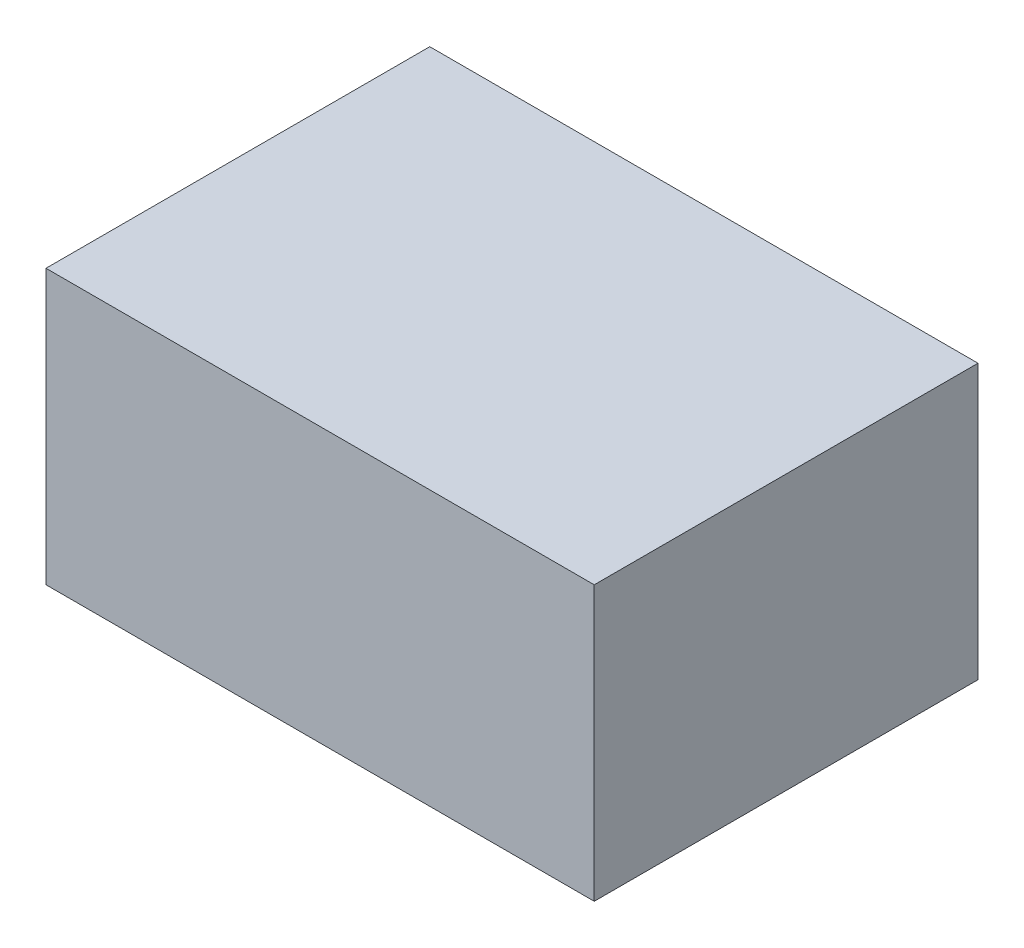
ISO-10303-21;
HEADER;
FILE_DESCRIPTION(('STEP AP214'),'2;1');
FILE_NAME('part.step','',(''),(''),'','','');
FILE_SCHEMA(('AUTOMOTIVE_DESIGN { 1 0 10303 214 1 1 1 1 }'));
ENDSEC;
DATA;
#1=APPLICATION_CONTEXT('core data for automotive mechanical design processes');
#2=APPLICATION_PROTOCOL_DEFINITION('international standard','automotive_design',2000,#1);
#3=PRODUCT_CONTEXT('',#1,'mechanical');
#4=PRODUCT('Part','Part','',(#3));
#5=PRODUCT_RELATED_PRODUCT_CATEGORY('part','',(#4));
#6=PRODUCT_DEFINITION_FORMATION('','',#4);
#7=PRODUCT_DEFINITION_CONTEXT('part definition',#1,'design');
#8=PRODUCT_DEFINITION('design','',#6,#7);
#9=PRODUCT_DEFINITION_SHAPE('','',#8);
#10=(LENGTH_UNIT() NAMED_UNIT(*) SI_UNIT(.MILLI.,.METRE.));
#11=(NAMED_UNIT(*) PLANE_ANGLE_UNIT() SI_UNIT($,.RADIAN.));
#12=(NAMED_UNIT(*) SI_UNIT($,.STERADIAN.) SOLID_ANGLE_UNIT());
#13=UNCERTAINTY_MEASURE_WITH_UNIT(LENGTH_MEASURE(1.E-05),#10,'distance_accuracy_value','');
#14=(GEOMETRIC_REPRESENTATION_CONTEXT(3) GLOBAL_UNCERTAINTY_ASSIGNED_CONTEXT((#13)) GLOBAL_UNIT_ASSIGNED_CONTEXT((#10,
#11,#12)) REPRESENTATION_CONTEXT('',''));
#15=CARTESIAN_POINT('',(0.,0.,0.));
#16=DIRECTION('',(0.,0.,1.));
#17=DIRECTION('',(1.,0.,0.));
#18=AXIS2_PLACEMENT_3D('',#15,#16,#17);
#19=CARTESIAN_POINT('',(-50.,50.,-35.));
#20=DIRECTION('',(1.,0.,0.));
#21=DIRECTION('',(0.,0.,-1.));
#22=AXIS2_PLACEMENT_3D('',#19,#20,#21);
#23=PLANE('',#22);
#24=DIRECTION('',(0.,0.,1.));
#25=VECTOR('',#24,1.);
#26=CARTESIAN_POINT('',(-50.,0.,-35.));
#27=LINE('',#26,#25);
#28=CARTESIAN_POINT('',(-50.,0.,-35.));
#29=VERTEX_POINT('',#28);
#30=CARTESIAN_POINT('',(-50.,0.,35.));
#31=VERTEX_POINT('',#30);
#32=EDGE_CURVE('E98',#29,#31,#27,.T.);
#33=ORIENTED_EDGE('',*,*,#32,.T.);
#34=DIRECTION('',(0.,-1.,0.));
#35=VECTOR('',#34,1.);
#36=CARTESIAN_POINT('',(-50.,50.,35.));
#37=LINE('',#36,#35);
#38=CARTESIAN_POINT('',(-50.,50.,35.));
#39=VERTEX_POINT('',#38);
#40=EDGE_CURVE('E11',#39,#31,#37,.T.);
#41=ORIENTED_EDGE('',*,*,#40,.F.);
#42=DIRECTION('',(0.,0.,1.));
#43=VECTOR('',#42,1.);
#44=CARTESIAN_POINT('',(-50.,50.,-35.));
#45=LINE('',#44,#43);
#46=CARTESIAN_POINT('',(-50.,50.,-35.));
#47=VERTEX_POINT('',#46);
#48=EDGE_CURVE('E86',#47,#39,#45,.T.);
#49=ORIENTED_EDGE('',*,*,#48,.F.);
#50=DIRECTION('',(0.,-1.,0.));
#51=VECTOR('',#50,1.);
#52=CARTESIAN_POINT('',(-50.,50.,-35.));
#53=LINE('',#52,#51);
#54=EDGE_CURVE('E94',#47,#29,#53,.T.);
#55=ORIENTED_EDGE('',*,*,#54,.T.);
#56=EDGE_LOOP('',(#33,#41,#49,#55));
#57=FACE_BOUND('',#56,.T.);
#58=ADVANCED_FACE('F35',(#57),#23,.F.);
#59=CARTESIAN_POINT('',(50.,50.,35.));
#60=DIRECTION('',(0.,0.,-1.));
#61=DIRECTION('',(-1.,0.,0.));
#62=AXIS2_PLACEMENT_3D('',#59,#60,#61);
#63=PLANE('',#62);
#64=DIRECTION('',(1.,0.,0.));
#65=VECTOR('',#64,1.);
#66=CARTESIAN_POINT('',(50.,0.,35.));
#67=LINE('',#66,#65);
#68=CARTESIAN_POINT('',(50.,0.,35.));
#69=VERTEX_POINT('',#68);
#70=EDGE_CURVE('E90',#31,#69,#67,.T.);
#71=ORIENTED_EDGE('',*,*,#70,.T.);
#72=DIRECTION('',(0.,-1.,0.));
#73=VECTOR('',#72,1.);
#74=CARTESIAN_POINT('',(50.,50.,35.));
#75=LINE('',#74,#73);
#76=CARTESIAN_POINT('',(50.,50.,35.));
#77=VERTEX_POINT('',#76);
#78=EDGE_CURVE('E43',#77,#69,#75,.T.);
#79=ORIENTED_EDGE('',*,*,#78,.F.);
#80=DIRECTION('',(1.,0.,0.));
#81=VECTOR('',#80,1.);
#82=CARTESIAN_POINT('',(50.,50.,35.));
#83=LINE('',#82,#81);
#84=EDGE_CURVE('E81',#39,#77,#83,.T.);
#85=ORIENTED_EDGE('',*,*,#84,.F.);
#86=ORIENTED_EDGE('',*,*,#40,.T.);
#87=EDGE_LOOP('',(#71,#79,#85,#86));
#88=FACE_BOUND('',#87,.T.);
#89=ADVANCED_FACE('F89',(#88),#63,.F.);
#90=CARTESIAN_POINT('',(50.,50.,-35.));
#91=DIRECTION('',(-1.,0.,0.));
#92=DIRECTION('',(0.,0.,1.));
#93=AXIS2_PLACEMENT_3D('',#90,#91,#92);
#94=PLANE('',#93);
#95=DIRECTION('',(0.,0.,-1.));
#96=VECTOR('',#95,1.);
#97=CARTESIAN_POINT('',(50.,0.,-35.));
#98=LINE('',#97,#96);
#99=CARTESIAN_POINT('',(50.,0.,-35.));
#100=VERTEX_POINT('',#99);
#101=EDGE_CURVE('E68',#69,#100,#98,.T.);
#102=ORIENTED_EDGE('',*,*,#101,.T.);
#103=DIRECTION('',(0.,-1.,0.));
#104=VECTOR('',#103,1.);
#105=CARTESIAN_POINT('',(50.,50.,-35.));
#106=LINE('',#105,#104);
#107=CARTESIAN_POINT('',(50.,50.,-35.));
#108=VERTEX_POINT('',#107);
#109=EDGE_CURVE('E91',#108,#100,#106,.T.);
#110=ORIENTED_EDGE('',*,*,#109,.F.);
#111=DIRECTION('',(0.,0.,-1.));
#112=VECTOR('',#111,1.);
#113=CARTESIAN_POINT('',(50.,50.,-35.));
#114=LINE('',#113,#112);
#115=EDGE_CURVE('E84',#77,#108,#114,.T.);
#116=ORIENTED_EDGE('',*,*,#115,.F.);
#117=ORIENTED_EDGE('',*,*,#78,.T.);
#118=EDGE_LOOP('',(#102,#110,#116,#117));
#119=FACE_BOUND('',#118,.T.);
#120=ADVANCED_FACE('F92',(#119),#94,.F.);
#121=CARTESIAN_POINT('',(50.,50.,-35.));
#122=DIRECTION('',(0.,0.,1.));
#123=DIRECTION('',(1.,0.,0.));
#124=AXIS2_PLACEMENT_3D('',#121,#122,#123);
#125=PLANE('',#124);
#126=DIRECTION('',(-1.,0.,0.));
#127=VECTOR('',#126,1.);
#128=CARTESIAN_POINT('',(50.,0.,-35.));
#129=LINE('',#128,#127);
#130=EDGE_CURVE('E74',#100,#29,#129,.T.);
#131=ORIENTED_EDGE('',*,*,#130,.T.);
#132=ORIENTED_EDGE('',*,*,#54,.F.);
#133=DIRECTION('',(-1.,0.,0.));
#134=VECTOR('',#133,1.);
#135=CARTESIAN_POINT('',(50.,50.,-35.));
#136=LINE('',#135,#134);
#137=EDGE_CURVE('E51',#108,#47,#136,.T.);
#138=ORIENTED_EDGE('',*,*,#137,.F.);
#139=ORIENTED_EDGE('',*,*,#109,.T.);
#140=EDGE_LOOP('',(#131,#132,#138,#139));
#141=FACE_BOUND('',#140,.T.);
#142=ADVANCED_FACE('F105',(#141),#125,.F.);
#143=CARTESIAN_POINT('',(0.,50.,0.));
#144=DIRECTION('',(0.,-1.,0.));
#145=DIRECTION('',(0.,0.,-1.));
#146=AXIS2_PLACEMENT_3D('',#143,#144,#145);
#147=PLANE('',#146);
#148=ORIENTED_EDGE('',*,*,#48,.T.);
#149=ORIENTED_EDGE('',*,*,#84,.T.);
#150=ORIENTED_EDGE('',*,*,#115,.T.);
#151=ORIENTED_EDGE('',*,*,#137,.T.);
#152=EDGE_LOOP('',(#148,#149,#150,#151));
#153=FACE_BOUND('',#152,.T.);
#154=ADVANCED_FACE('F82',(#153),#147,.F.);
#155=CARTESIAN_POINT('',(0.,0.,0.));
#156=DIRECTION('',(0.,-1.,0.));
#157=DIRECTION('',(0.,0.,-1.));
#158=AXIS2_PLACEMENT_3D('',#155,#156,#157);
#159=PLANE('',#158);
#160=ORIENTED_EDGE('',*,*,#32,.F.);
#161=ORIENTED_EDGE('',*,*,#130,.F.);
#162=ORIENTED_EDGE('',*,*,#101,.F.);
#163=ORIENTED_EDGE('',*,*,#70,.F.);
#164=EDGE_LOOP('',(#160,#161,#162,#163));
#165=FACE_BOUND('',#164,.T.);
#166=ADVANCED_FACE('F108',(#165),#159,.T.);
#167=CLOSED_SHELL('',(#58,#89,#120,#142,#154,#166));
#168=MANIFOLD_SOLID_BREP('B2',#167);
#169=ADVANCED_BREP_SHAPE_REPRESENTATION('',(#18,#168),#14);
#170=SHAPE_DEFINITION_REPRESENTATION(#9,#169);
ENDSEC;
END-ISO-10303-21;
